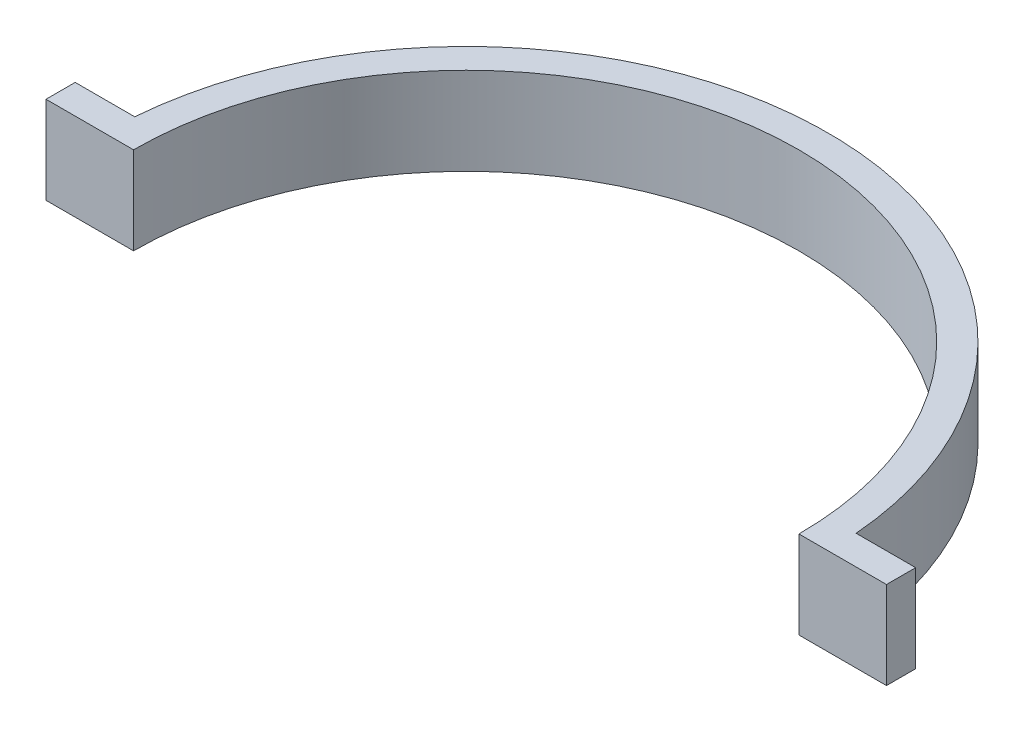
ISO-10303-21;
HEADER;
FILE_DESCRIPTION(('STEP AP214'),'2;1');
FILE_NAME('part.step','',(''),(''),'','','');
FILE_SCHEMA(('AUTOMOTIVE_DESIGN { 1 0 10303 214 1 1 1 1 }'));
ENDSEC;
DATA;
#1=APPLICATION_CONTEXT('core data for automotive mechanical design processes');
#2=APPLICATION_PROTOCOL_DEFINITION('international standard','automotive_design',2000,#1);
#3=PRODUCT_CONTEXT('',#1,'mechanical');
#4=PRODUCT('Part','Part','',(#3));
#5=PRODUCT_RELATED_PRODUCT_CATEGORY('part','',(#4));
#6=PRODUCT_DEFINITION_FORMATION('','',#4);
#7=PRODUCT_DEFINITION_CONTEXT('part definition',#1,'design');
#8=PRODUCT_DEFINITION('design','',#6,#7);
#9=PRODUCT_DEFINITION_SHAPE('','',#8);
#10=(LENGTH_UNIT() NAMED_UNIT(*) SI_UNIT(.MILLI.,.METRE.));
#11=(NAMED_UNIT(*) PLANE_ANGLE_UNIT() SI_UNIT($,.RADIAN.));
#12=(NAMED_UNIT(*) SI_UNIT($,.STERADIAN.) SOLID_ANGLE_UNIT());
#13=UNCERTAINTY_MEASURE_WITH_UNIT(LENGTH_MEASURE(1.E-05),#10,'distance_accuracy_value','');
#14=(GEOMETRIC_REPRESENTATION_CONTEXT(3) GLOBAL_UNCERTAINTY_ASSIGNED_CONTEXT((#13)) GLOBAL_UNIT_ASSIGNED_CONTEXT((#10,
#11,#12)) REPRESENTATION_CONTEXT('',''));
#15=CARTESIAN_POINT('',(0.,0.,0.));
#16=DIRECTION('',(0.,0.,1.));
#17=DIRECTION('',(1.,0.,0.));
#18=AXIS2_PLACEMENT_3D('',#15,#16,#17);
#19=CARTESIAN_POINT('',(0.,-72.1063614073978,0.));
#20=DIRECTION('',(0.,-1.,0.));
#21=DIRECTION('',(0.,0.,-1.));
#22=AXIS2_PLACEMENT_3D('',#19,#20,#21);
#23=CYLINDRICAL_SURFACE('',#22,39.37);
#24=DIRECTION('',(0.,-1.,0.));
#25=VECTOR('',#24,1.);
#26=CARTESIAN_POINT('',(-39.2417669709202,-72.1063614073978,-3.17499999999971));
#27=LINE('',#26,#25);
#28=CARTESIAN_POINT('',(-39.2417669709202,-4.7625,-3.17499999999973));
#29=VERTEX_POINT('',#28);
#30=CARTESIAN_POINT('',(-39.2417669709202,4.7625,-3.17499999999973));
#31=VERTEX_POINT('',#30);
#32=EDGE_CURVE('E53',#29,#31,#27,.F.);
#33=ORIENTED_EDGE('',*,*,#32,.T.);
#34=CARTESIAN_POINT('',(0.,4.7625,0.));
#35=DIRECTION('',(0.,-1.,0.));
#36=DIRECTION('',(0.,0.,-1.));
#37=AXIS2_PLACEMENT_3D('',#34,#35,#36);
#38=CIRCLE('',#37,39.37);
#39=CARTESIAN_POINT('',(39.2417669709201,4.7625,-3.17500000000001));
#40=VERTEX_POINT('',#39);
#41=EDGE_CURVE('E104',#31,#40,#38,.T.);
#42=ORIENTED_EDGE('',*,*,#41,.T.);
#43=DIRECTION('',(0.,-1.,0.));
#44=VECTOR('',#43,1.);
#45=CARTESIAN_POINT('',(39.2417669709201,-72.1063614073978,-3.17500000000001));
#46=LINE('',#45,#44);
#47=CARTESIAN_POINT('',(39.2417669709201,-4.7625,-3.175));
#48=VERTEX_POINT('',#47);
#49=EDGE_CURVE('E139',#40,#48,#46,.T.);
#50=ORIENTED_EDGE('',*,*,#49,.T.);
#51=CARTESIAN_POINT('',(0.,-4.7625,0.));
#52=DIRECTION('',(0.,-1.,0.));
#53=DIRECTION('',(0.,0.,-1.));
#54=AXIS2_PLACEMENT_3D('',#51,#52,#53);
#55=CIRCLE('',#54,39.37);
#56=EDGE_CURVE('E11',#29,#48,#55,.T.);
#57=ORIENTED_EDGE('',*,*,#56,.F.);
#58=EDGE_LOOP('',(#33,#42,#50,#57));
#59=FACE_BOUND('',#58,.T.);
#60=ADVANCED_FACE('F35',(#59),#23,.T.);
#61=CARTESIAN_POINT('',(-36.195,-4.7625,2.52748334118854E-13));
#62=DIRECTION('',(0.,-1.,0.));
#63=DIRECTION('',(0.,0.,-1.));
#64=AXIS2_PLACEMENT_3D('',#61,#62,#63);
#65=PLANE('',#64);
#66=CARTESIAN_POINT('',(0.,-4.7625,0.));
#67=DIRECTION('',(0.,-1.,0.));
#68=DIRECTION('',(0.,0.,-1.));
#69=AXIS2_PLACEMENT_3D('',#66,#67,#68);
#70=CIRCLE('',#69,36.195);
#71=CARTESIAN_POINT('',(-36.195,-4.7625,2.52748334118854E-13));
#72=VERTEX_POINT('',#71);
#73=CARTESIAN_POINT('',(36.195,-4.7625,0.));
#74=VERTEX_POINT('',#73);
#75=EDGE_CURVE('E43',#72,#74,#70,.T.);
#76=ORIENTED_EDGE('',*,*,#75,.F.);
#77=DIRECTION('',(-1.,0.,0.));
#78=VECTOR('',#77,1.);
#79=CARTESIAN_POINT('',(-36.195,-4.7625,2.52748334118854E-13));
#80=LINE('',#79,#78);
#81=CARTESIAN_POINT('',(-45.72,-4.7625,2.71371895580244E-13));
#82=VERTEX_POINT('',#81);
#83=EDGE_CURVE('E157',#72,#82,#80,.T.);
#84=ORIENTED_EDGE('',*,*,#83,.T.);
#85=DIRECTION('',(0.,0.,1.));
#86=VECTOR('',#85,1.);
#87=CARTESIAN_POINT('',(-45.72,-4.7625,2.71371895580244E-13));
#88=LINE('',#87,#86);
#89=CARTESIAN_POINT('',(-45.72,-4.7625,-3.17499999999973));
#90=VERTEX_POINT('',#89);
#91=EDGE_CURVE('E115',#90,#82,#88,.T.);
#92=ORIENTED_EDGE('',*,*,#91,.F.);
#93=DIRECTION('',(-1.,0.,0.));
#94=VECTOR('',#93,1.);
#95=CARTESIAN_POINT('',(45.721,-4.7625,-3.17499999999973));
#96=LINE('',#95,#94);
#97=EDGE_CURVE('E106',#29,#90,#96,.T.);
#98=ORIENTED_EDGE('',*,*,#97,.F.);
#99=ORIENTED_EDGE('',*,*,#56,.T.);
#100=DIRECTION('',(1.,0.,0.));
#101=VECTOR('',#100,1.);
#102=CARTESIAN_POINT('',(-39.371,-4.7625,-3.175));
#103=LINE('',#102,#101);
#104=CARTESIAN_POINT('',(45.72,-4.7625,-3.175));
#105=VERTEX_POINT('',#104);
#106=EDGE_CURVE('E138',#48,#105,#103,.T.);
#107=ORIENTED_EDGE('',*,*,#106,.T.);
#108=DIRECTION('',(0.,0.,-1.));
#109=VECTOR('',#108,1.);
#110=CARTESIAN_POINT('',(45.72,-4.7625,0.));
#111=LINE('',#110,#109);
#112=CARTESIAN_POINT('',(45.72,-4.7625,0.));
#113=VERTEX_POINT('',#112);
#114=EDGE_CURVE('E132',#113,#105,#111,.T.);
#115=ORIENTED_EDGE('',*,*,#114,.F.);
#116=DIRECTION('',(1.,0.,0.));
#117=VECTOR('',#116,1.);
#118=CARTESIAN_POINT('',(36.195,-4.7625,0.));
#119=LINE('',#118,#117);
#120=EDGE_CURVE('E150',#74,#113,#119,.T.);
#121=ORIENTED_EDGE('',*,*,#120,.F.);
#122=EDGE_LOOP('',(#76,#84,#92,#98,#99,#107,#115,#121));
#123=FACE_BOUND('',#122,.T.);
#124=ADVANCED_FACE('F37',(#123),#65,.T.);
#125=CARTESIAN_POINT('',(0.,-72.1063614073978,0.));
#126=DIRECTION('',(0.,-1.,0.));
#127=DIRECTION('',(0.,0.,-1.));
#128=AXIS2_PLACEMENT_3D('',#125,#126,#127);
#129=CYLINDRICAL_SURFACE('',#128,36.195);
#130=CARTESIAN_POINT('',(0.,4.7625,0.));
#131=DIRECTION('',(0.,-1.,0.));
#132=DIRECTION('',(0.,0.,-1.));
#133=AXIS2_PLACEMENT_3D('',#130,#131,#132);
#134=CIRCLE('',#133,36.195);
#135=CARTESIAN_POINT('',(-36.195,4.7625,2.52748334118854E-13));
#136=VERTEX_POINT('',#135);
#137=CARTESIAN_POINT('',(36.195,4.7625,0.));
#138=VERTEX_POINT('',#137);
#139=EDGE_CURVE('E160',#136,#138,#134,.T.);
#140=ORIENTED_EDGE('',*,*,#139,.F.);
#141=DIRECTION('',(0.,-1.,0.));
#142=VECTOR('',#141,1.);
#143=CARTESIAN_POINT('',(-36.195,-4.7625,2.52748334118854E-13));
#144=LINE('',#143,#142);
#145=EDGE_CURVE('E154',#136,#72,#144,.T.);
#146=ORIENTED_EDGE('',*,*,#145,.T.);
#147=ORIENTED_EDGE('',*,*,#75,.T.);
#148=DIRECTION('',(0.,-1.,0.));
#149=VECTOR('',#148,1.);
#150=CARTESIAN_POINT('',(36.195,-4.7625,0.));
#151=LINE('',#150,#149);
#152=EDGE_CURVE('E147',#138,#74,#151,.T.);
#153=ORIENTED_EDGE('',*,*,#152,.F.);
#154=EDGE_LOOP('',(#140,#146,#147,#153));
#155=FACE_BOUND('',#154,.T.);
#156=ADVANCED_FACE('F163',(#155),#129,.F.);
#157=CARTESIAN_POINT('',(-36.195,4.7625,2.52748334118854E-13));
#158=DIRECTION('',(0.,1.,0.));
#159=DIRECTION('',(0.,0.,1.));
#160=AXIS2_PLACEMENT_3D('',#157,#158,#159);
#161=PLANE('',#160);
#162=DIRECTION('',(1.,0.,0.));
#163=VECTOR('',#162,1.);
#164=CARTESIAN_POINT('',(-36.195,4.7625,2.52748334118854E-13));
#165=LINE('',#164,#163);
#166=CARTESIAN_POINT('',(-45.72,4.7625,2.71371895580244E-13));
#167=VERTEX_POINT('',#166);
#168=EDGE_CURVE('E152',#167,#136,#165,.T.);
#169=ORIENTED_EDGE('',*,*,#168,.T.);
#170=ORIENTED_EDGE('',*,*,#139,.T.);
#171=DIRECTION('',(-1.,0.,0.));
#172=VECTOR('',#171,1.);
#173=CARTESIAN_POINT('',(36.195,4.7625,0.));
#174=LINE('',#173,#172);
#175=CARTESIAN_POINT('',(45.72,4.7625,0.));
#176=VERTEX_POINT('',#175);
#177=EDGE_CURVE('E141',#176,#138,#174,.T.);
#178=ORIENTED_EDGE('',*,*,#177,.F.);
#179=DIRECTION('',(0.,0.,1.));
#180=VECTOR('',#179,1.);
#181=CARTESIAN_POINT('',(45.72,4.7625,0.));
#182=LINE('',#181,#180);
#183=CARTESIAN_POINT('',(45.72,4.7625,-3.175));
#184=VERTEX_POINT('',#183);
#185=EDGE_CURVE('E125',#184,#176,#182,.T.);
#186=ORIENTED_EDGE('',*,*,#185,.F.);
#187=DIRECTION('',(1.,0.,0.));
#188=VECTOR('',#187,1.);
#189=CARTESIAN_POINT('',(-39.371,4.7625,-3.175));
#190=LINE('',#189,#188);
#191=EDGE_CURVE('E142',#40,#184,#190,.T.);
#192=ORIENTED_EDGE('',*,*,#191,.F.);
#193=ORIENTED_EDGE('',*,*,#41,.F.);
#194=DIRECTION('',(-1.,0.,0.));
#195=VECTOR('',#194,1.);
#196=CARTESIAN_POINT('',(45.721,4.7625,-3.17499999999973));
#197=LINE('',#196,#195);
#198=CARTESIAN_POINT('',(-45.72,4.7625,-3.17499999999973));
#199=VERTEX_POINT('',#198);
#200=EDGE_CURVE('E97',#31,#199,#197,.T.);
#201=ORIENTED_EDGE('',*,*,#200,.T.);
#202=DIRECTION('',(0.,0.,-1.));
#203=VECTOR('',#202,1.);
#204=CARTESIAN_POINT('',(-45.72,4.7625,2.71371895580244E-13));
#205=LINE('',#204,#203);
#206=EDGE_CURVE('E102',#167,#199,#205,.T.);
#207=ORIENTED_EDGE('',*,*,#206,.F.);
#208=EDGE_LOOP('',(#169,#170,#178,#186,#192,#193,#201,#207));
#209=FACE_BOUND('',#208,.T.);
#210=ADVANCED_FACE('F100',(#209),#161,.T.);
#211=CARTESIAN_POINT('',(0.,0.,0.));
#212=DIRECTION('',(0.,0.,1.));
#213=DIRECTION('',(1.,0.,0.));
#214=AXIS2_PLACEMENT_3D('',#211,#212,#213);
#215=PLANE('',#214);
#216=ORIENTED_EDGE('',*,*,#168,.F.);
#217=DIRECTION('',(0.,1.,0.));
#218=VECTOR('',#217,1.);
#219=CARTESIAN_POINT('',(-45.72,4.7625,2.71371895580244E-13));
#220=LINE('',#219,#218);
#221=EDGE_CURVE('E107',#82,#167,#220,.T.);
#222=ORIENTED_EDGE('',*,*,#221,.F.);
#223=ORIENTED_EDGE('',*,*,#83,.F.);
#224=ORIENTED_EDGE('',*,*,#145,.F.);
#225=EDGE_LOOP('',(#216,#222,#223,#224));
#226=FACE_BOUND('',#225,.T.);
#227=ADVANCED_FACE('F181',(#226),#215,.T.);
#228=CARTESIAN_POINT('',(0.,0.,0.));
#229=DIRECTION('',(0.,0.,-1.));
#230=DIRECTION('',(-1.,0.,0.));
#231=AXIS2_PLACEMENT_3D('',#228,#229,#230);
#232=PLANE('',#231);
#233=ORIENTED_EDGE('',*,*,#120,.T.);
#234=DIRECTION('',(0.,-1.,0.));
#235=VECTOR('',#234,1.);
#236=CARTESIAN_POINT('',(45.72,4.7625,0.));
#237=LINE('',#236,#235);
#238=EDGE_CURVE('E129',#176,#113,#237,.T.);
#239=ORIENTED_EDGE('',*,*,#238,.F.);
#240=ORIENTED_EDGE('',*,*,#177,.T.);
#241=ORIENTED_EDGE('',*,*,#152,.T.);
#242=EDGE_LOOP('',(#233,#239,#240,#241));
#243=FACE_BOUND('',#242,.T.);
#244=ADVANCED_FACE('F169',(#243),#232,.F.);
#245=CARTESIAN_POINT('',(-39.371,4.7625,-3.175));
#246=DIRECTION('',(0.,0.,-1.));
#247=DIRECTION('',(0.,1.,0.));
#248=AXIS2_PLACEMENT_3D('',#245,#246,#247);
#249=PLANE('',#248);
#250=ORIENTED_EDGE('',*,*,#49,.F.);
#251=ORIENTED_EDGE('',*,*,#191,.T.);
#252=DIRECTION('',(0.,1.,0.));
#253=VECTOR('',#252,1.);
#254=CARTESIAN_POINT('',(45.72,4.7625,-3.175));
#255=LINE('',#254,#253);
#256=EDGE_CURVE('E135',#105,#184,#255,.T.);
#257=ORIENTED_EDGE('',*,*,#256,.F.);
#258=ORIENTED_EDGE('',*,*,#106,.F.);
#259=EDGE_LOOP('',(#250,#251,#257,#258));
#260=FACE_BOUND('',#259,.T.);
#261=ADVANCED_FACE('F179',(#260),#249,.T.);
#262=CARTESIAN_POINT('',(45.72,0.,0.));
#263=DIRECTION('',(-1.,0.,0.));
#264=DIRECTION('',(0.,0.,1.));
#265=AXIS2_PLACEMENT_3D('',#262,#263,#264);
#266=PLANE('',#265);
#267=ORIENTED_EDGE('',*,*,#185,.T.);
#268=ORIENTED_EDGE('',*,*,#238,.T.);
#269=ORIENTED_EDGE('',*,*,#114,.T.);
#270=ORIENTED_EDGE('',*,*,#256,.T.);
#271=EDGE_LOOP('',(#267,#268,#269,#270));
#272=FACE_BOUND('',#271,.T.);
#273=ADVANCED_FACE('F175',(#272),#266,.F.);
#274=CARTESIAN_POINT('',(45.721,4.7625,-3.17499999999973));
#275=DIRECTION('',(0.,0.,-1.));
#276=DIRECTION('',(0.,1.,0.));
#277=AXIS2_PLACEMENT_3D('',#274,#275,#276);
#278=PLANE('',#277);
#279=ORIENTED_EDGE('',*,*,#32,.F.);
#280=ORIENTED_EDGE('',*,*,#97,.T.);
#281=DIRECTION('',(0.,-1.,0.));
#282=VECTOR('',#281,1.);
#283=CARTESIAN_POINT('',(-45.72,4.7625,-3.17499999999973));
#284=LINE('',#283,#282);
#285=EDGE_CURVE('E110',#199,#90,#284,.T.);
#286=ORIENTED_EDGE('',*,*,#285,.F.);
#287=ORIENTED_EDGE('',*,*,#200,.F.);
#288=EDGE_LOOP('',(#279,#280,#286,#287));
#289=FACE_BOUND('',#288,.T.);
#290=ADVANCED_FACE('F111',(#289),#278,.T.);
#291=CARTESIAN_POINT('',(-45.72,0.,0.));
#292=DIRECTION('',(-1.,0.,0.));
#293=DIRECTION('',(0.,0.,1.));
#294=AXIS2_PLACEMENT_3D('',#291,#292,#293);
#295=PLANE('',#294);
#296=ORIENTED_EDGE('',*,*,#206,.T.);
#297=ORIENTED_EDGE('',*,*,#285,.T.);
#298=ORIENTED_EDGE('',*,*,#91,.T.);
#299=ORIENTED_EDGE('',*,*,#221,.T.);
#300=EDGE_LOOP('',(#296,#297,#298,#299));
#301=FACE_BOUND('',#300,.T.);
#302=ADVANCED_FACE('F118',(#301),#295,.T.);
#303=CLOSED_SHELL('',(#60,#124,#156,#210,#227,#244,#261,#273,#290,#302));
#304=MANIFOLD_SOLID_BREP('B2',#303);
#305=ADVANCED_BREP_SHAPE_REPRESENTATION('',(#18,#304),#14);
#306=SHAPE_DEFINITION_REPRESENTATION(#9,#305);
ENDSEC;
END-ISO-10303-21;
